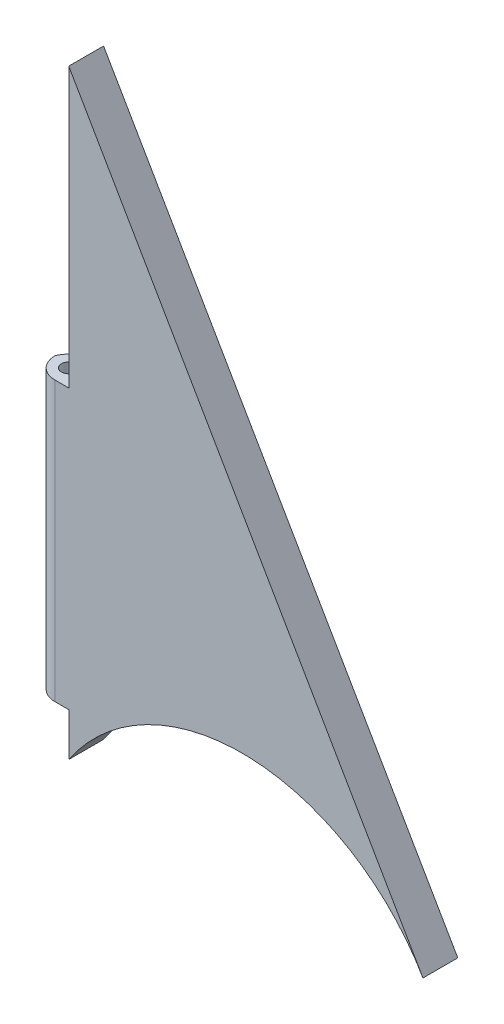
ISO-10303-21;
HEADER;
FILE_DESCRIPTION(('STEP AP214'),'2;1');
FILE_NAME('part.step','',(''),(''),'','','');
FILE_SCHEMA(('AUTOMOTIVE_DESIGN { 1 0 10303 214 1 1 1 1 }'));
ENDSEC;
DATA;
#1=APPLICATION_CONTEXT('core data for automotive mechanical design processes');
#2=APPLICATION_PROTOCOL_DEFINITION('international standard','automotive_design',2000,#1);
#3=PRODUCT_CONTEXT('',#1,'mechanical');
#4=PRODUCT('Part','Part','',(#3));
#5=PRODUCT_RELATED_PRODUCT_CATEGORY('part','',(#4));
#6=PRODUCT_DEFINITION_FORMATION('','',#4);
#7=PRODUCT_DEFINITION_CONTEXT('part definition',#1,'design');
#8=PRODUCT_DEFINITION('design','',#6,#7);
#9=PRODUCT_DEFINITION_SHAPE('','',#8);
#10=(LENGTH_UNIT() NAMED_UNIT(*) SI_UNIT(.MILLI.,.METRE.));
#11=(NAMED_UNIT(*) PLANE_ANGLE_UNIT() SI_UNIT($,.RADIAN.));
#12=(NAMED_UNIT(*) SI_UNIT($,.STERADIAN.) SOLID_ANGLE_UNIT());
#13=UNCERTAINTY_MEASURE_WITH_UNIT(LENGTH_MEASURE(1.E-05),#10,'distance_accuracy_value','');
#14=(GEOMETRIC_REPRESENTATION_CONTEXT(3) GLOBAL_UNCERTAINTY_ASSIGNED_CONTEXT((#13)) GLOBAL_UNIT_ASSIGNED_CONTEXT((#10,
#11,#12)) REPRESENTATION_CONTEXT('',''));
#15=CARTESIAN_POINT('',(0.,0.,0.));
#16=DIRECTION('',(0.,0.,1.));
#17=DIRECTION('',(1.,0.,0.));
#18=AXIS2_PLACEMENT_3D('',#15,#16,#17);
#19=CARTESIAN_POINT('',(-24.8298059769717,87.5088118938212,5.));
#20=DIRECTION('',(1.,0.,0.));
#21=DIRECTION('',(0.,0.,-1.));
#22=AXIS2_PLACEMENT_3D('',#19,#20,#21);
#23=PLANE('',#22);
#24=DIRECTION('',(0.,0.,-1.));
#25=VECTOR('',#24,1.);
#26=CARTESIAN_POINT('',(-24.8298059769717,47.4898845,5.));
#27=LINE('',#26,#25);
#28=CARTESIAN_POINT('',(-24.8298059769717,47.4898845,5.));
#29=VERTEX_POINT('',#28);
#30=CARTESIAN_POINT('',(-24.8298059769717,47.4898845,0.));
#31=VERTEX_POINT('',#30);
#32=EDGE_CURVE('E167',#29,#31,#27,.T.);
#33=ORIENTED_EDGE('',*,*,#32,.F.);
#34=DIRECTION('',(0.,-1.,0.));
#35=VECTOR('',#34,1.);
#36=CARTESIAN_POINT('',(-24.8298059769717,87.5088118938212,5.));
#37=LINE('',#36,#35);
#38=CARTESIAN_POINT('',(-24.8298059769717,87.5088118938212,5.));
#39=VERTEX_POINT('',#38);
#40=EDGE_CURVE('E119',#39,#29,#37,.T.);
#41=ORIENTED_EDGE('',*,*,#40,.F.);
#42=DIRECTION('',(0.,0.,-1.));
#43=VECTOR('',#42,1.);
#44=CARTESIAN_POINT('',(-24.8298059769717,87.5088118938212,5.));
#45=LINE('',#44,#43);
#46=CARTESIAN_POINT('',(-24.8298059769717,87.5088118938212,0.));
#47=VERTEX_POINT('',#46);
#48=EDGE_CURVE('E142',#39,#47,#45,.T.);
#49=ORIENTED_EDGE('',*,*,#48,.T.);
#50=DIRECTION('',(0.,-1.,0.));
#51=VECTOR('',#50,1.);
#52=CARTESIAN_POINT('',(-24.8298059769717,87.5088118938212,0.));
#53=LINE('',#52,#51);
#54=EDGE_CURVE('E135',#47,#31,#53,.T.);
#55=ORIENTED_EDGE('',*,*,#54,.T.);
#56=EDGE_LOOP('',(#33,#41,#49,#55));
#57=FACE_BOUND('',#56,.T.);
#58=ADVANCED_FACE('F33',(#57),#23,.F.);
#59=CARTESIAN_POINT('',(26.0250210520275,-0.447992933347607,5.));
#60=DIRECTION('',(-0.865714362691107,-0.500538352407016,0.));
#61=DIRECTION('',(0.500538352407016,-0.865714362691107,0.));
#62=AXIS2_PLACEMENT_3D('',#59,#60,#61);
#63=PLANE('',#62);
#64=DIRECTION('',(-0.500538352407016,0.865714362691107,0.));
#65=VECTOR('',#64,1.);
#66=CARTESIAN_POINT('',(26.0250210520275,-0.447992933347607,0.));
#67=LINE('',#66,#65);
#68=CARTESIAN_POINT('',(26.0250210520275,-0.447992933347605,0.));
#69=VERTEX_POINT('',#68);
#70=EDGE_CURVE('E131',#69,#47,#67,.T.);
#71=ORIENTED_EDGE('',*,*,#70,.T.);
#72=ORIENTED_EDGE('',*,*,#48,.F.);
#73=DIRECTION('',(-0.500538352407016,0.865714362691107,0.));
#74=VECTOR('',#73,1.);
#75=CARTESIAN_POINT('',(26.0250210520275,-0.447992933347607,5.));
#76=LINE('',#75,#74);
#77=CARTESIAN_POINT('',(26.0250210520275,-0.447992933347605,5.));
#78=VERTEX_POINT('',#77);
#79=EDGE_CURVE('E120',#78,#39,#76,.T.);
#80=ORIENTED_EDGE('',*,*,#79,.F.);
#81=DIRECTION('',(0.,0.,-1.));
#82=VECTOR('',#81,1.);
#83=CARTESIAN_POINT('',(26.0250210520275,-0.447992933347605,5.));
#84=LINE('',#83,#82);
#85=EDGE_CURVE('E130',#78,#69,#84,.T.);
#86=ORIENTED_EDGE('',*,*,#85,.T.);
#87=EDGE_LOOP('',(#71,#72,#80,#86));
#88=FACE_BOUND('',#87,.T.);
#89=ADVANCED_FACE('F178',(#88),#63,.F.);
#90=CARTESIAN_POINT('',(-24.8298059769717,7.4898845,5.));
#91=VERTEX_POINT('',#90);
#92=CARTESIAN_POINT('',(-24.8298059769717,1.29343973691645,5.));
#93=VERTEX_POINT('',#92);
#94=EDGE_CURVE('E101',#91,#93,#37,.T.);
#95=ORIENTED_EDGE('',*,*,#94,.F.);
#96=DIRECTION('',(0.,0.,-1.));
#97=VECTOR('',#96,1.);
#98=CARTESIAN_POINT('',(-24.8298059769717,7.4898845,5.));
#99=LINE('',#98,#97);
#100=CARTESIAN_POINT('',(-24.8298059769717,7.4898845,0.));
#101=VERTEX_POINT('',#100);
#102=EDGE_CURVE('E106',#91,#101,#99,.T.);
#103=ORIENTED_EDGE('',*,*,#102,.T.);
#104=CARTESIAN_POINT('',(-24.8298059769717,1.29343973691645,0.));
#105=VERTEX_POINT('',#104);
#106=EDGE_CURVE('E134',#101,#105,#53,.T.);
#107=ORIENTED_EDGE('',*,*,#106,.T.);
#108=DIRECTION('',(0.,0.,-1.));
#109=VECTOR('',#108,1.);
#110=CARTESIAN_POINT('',(-24.8298059769717,1.29343973691645,5.));
#111=LINE('',#110,#109);
#112=EDGE_CURVE('E117',#93,#105,#111,.T.);
#113=ORIENTED_EDGE('',*,*,#112,.F.);
#114=EDGE_LOOP('',(#95,#103,#107,#113));
#115=FACE_BOUND('',#114,.T.);
#116=ADVANCED_FACE('F115',(#115),#23,.F.);
#117=CARTESIAN_POINT('',(0.0535901712942575,-15.4641435055581,5.));
#118=DIRECTION('',(0.,0.,-1.));
#119=DIRECTION('',(-1.,0.,0.));
#120=AXIS2_PLACEMENT_3D('',#117,#118,#119);
#121=CYLINDRICAL_SURFACE('',#120,30.);
#122=CARTESIAN_POINT('',(0.0535901712942575,-15.4641435055581,0.));
#123=DIRECTION('',(0.,0.,1.));
#124=DIRECTION('',(1.,0.,0.));
#125=AXIS2_PLACEMENT_3D('',#122,#123,#124);
#126=CIRCLE('',#125,30.);
#127=EDGE_CURVE('E125',#69,#105,#126,.T.);
#128=ORIENTED_EDGE('',*,*,#127,.F.);
#129=ORIENTED_EDGE('',*,*,#85,.F.);
#130=CARTESIAN_POINT('',(0.0535901712942575,-15.4641435055581,5.));
#131=DIRECTION('',(0.,0.,1.));
#132=DIRECTION('',(1.,0.,0.));
#133=AXIS2_PLACEMENT_3D('',#130,#131,#132);
#134=CIRCLE('',#133,30.);
#135=EDGE_CURVE('E123',#78,#93,#134,.T.);
#136=ORIENTED_EDGE('',*,*,#135,.T.);
#137=ORIENTED_EDGE('',*,*,#112,.T.);
#138=EDGE_LOOP('',(#128,#129,#136,#137));
#139=FACE_BOUND('',#138,.T.);
#140=ADVANCED_FACE('F176',(#139),#121,.F.);
#141=CARTESIAN_POINT('',(0.0535901712942575,-15.4641435055581,5.));
#142=DIRECTION('',(0.,0.,1.));
#143=DIRECTION('',(1.,0.,0.));
#144=AXIS2_PLACEMENT_3D('',#141,#142,#143);
#145=PLANE('',#144);
#146=DIRECTION('',(1.,0.,0.));
#147=VECTOR('',#146,1.);
#148=CARTESIAN_POINT('',(-24.8298059769717,47.4898845,5.));
#149=LINE('',#148,#147);
#150=CARTESIAN_POINT('',(-26.8298059769717,47.4898845,5.));
#151=VERTEX_POINT('',#150);
#152=EDGE_CURVE('E165',#151,#29,#149,.T.);
#153=ORIENTED_EDGE('',*,*,#152,.F.);
#154=DIRECTION('',(0.,1.,0.));
#155=VECTOR('',#154,1.);
#156=CARTESIAN_POINT('',(-26.8298059769717,-15.4641435055581,5.));
#157=LINE('',#156,#155);
#158=CARTESIAN_POINT('',(-26.8298059769717,7.4898845,5.));
#159=VERTEX_POINT('',#158);
#160=EDGE_CURVE('E104',#151,#159,#157,.F.);
#161=ORIENTED_EDGE('',*,*,#160,.T.);
#162=DIRECTION('',(1.,0.,0.));
#163=VECTOR('',#162,1.);
#164=CARTESIAN_POINT('',(-24.8298059769717,7.4898845,5.));
#165=LINE('',#164,#163);
#166=EDGE_CURVE('E95',#159,#91,#165,.T.);
#167=ORIENTED_EDGE('',*,*,#166,.T.);
#168=ORIENTED_EDGE('',*,*,#94,.T.);
#169=ORIENTED_EDGE('',*,*,#135,.F.);
#170=ORIENTED_EDGE('',*,*,#79,.T.);
#171=ORIENTED_EDGE('',*,*,#40,.T.);
#172=EDGE_LOOP('',(#153,#161,#167,#168,#169,#170,#171));
#173=FACE_BOUND('',#172,.T.);
#174=ADVANCED_FACE('F98',(#173),#145,.T.);
#175=CARTESIAN_POINT('',(0.0535901712942575,-15.4641435055581,0.));
#176=DIRECTION('',(0.,0.,1.));
#177=DIRECTION('',(1.,0.,0.));
#178=AXIS2_PLACEMENT_3D('',#175,#176,#177);
#179=PLANE('',#178);
#180=DIRECTION('',(-1.,0.,0.));
#181=VECTOR('',#180,1.);
#182=CARTESIAN_POINT('',(-24.8298059769717,7.4898845,0.));
#183=LINE('',#182,#181);
#184=CARTESIAN_POINT('',(-27.0013788522255,7.4898845,0.));
#185=VERTEX_POINT('',#184);
#186=EDGE_CURVE('E111',#101,#185,#183,.T.);
#187=ORIENTED_EDGE('',*,*,#186,.T.);
#188=DIRECTION('',(0.,1.,0.));
#189=VECTOR('',#188,1.);
#190=CARTESIAN_POINT('',(-27.0013788522255,-15.4641435055581,0.));
#191=LINE('',#190,#189);
#192=CARTESIAN_POINT('',(-27.0013788522255,47.4898845,0.));
#193=VERTEX_POINT('',#192);
#194=EDGE_CURVE('E152',#185,#193,#191,.T.);
#195=ORIENTED_EDGE('',*,*,#194,.T.);
#196=DIRECTION('',(-1.,0.,0.));
#197=VECTOR('',#196,1.);
#198=CARTESIAN_POINT('',(-24.8298059769717,47.4898845,0.));
#199=LINE('',#198,#197);
#200=EDGE_CURVE('E107',#31,#193,#199,.T.);
#201=ORIENTED_EDGE('',*,*,#200,.F.);
#202=ORIENTED_EDGE('',*,*,#54,.F.);
#203=ORIENTED_EDGE('',*,*,#70,.F.);
#204=ORIENTED_EDGE('',*,*,#127,.T.);
#205=ORIENTED_EDGE('',*,*,#106,.F.);
#206=EDGE_LOOP('',(#187,#195,#201,#202,#203,#204,#205));
#207=FACE_BOUND('',#206,.T.);
#208=ADVANCED_FACE('F162',(#207),#179,.F.);
#209=CARTESIAN_POINT('',(0.,7.4898845,0.));
#210=DIRECTION('',(0.,-1.,0.));
#211=DIRECTION('',(0.,0.,-1.));
#212=AXIS2_PLACEMENT_3D('',#209,#210,#211);
#213=PLANE('',#212);
#214=CARTESIAN_POINT('',(-27.3298059769717,7.4898845,2.5));
#215=DIRECTION('',(0.,1.,0.));
#216=DIRECTION('',(0.,0.,1.));
#217=AXIS2_PLACEMENT_3D('',#214,#215,#216);
#218=CIRCLE('',#217,1.04882047176918);
#219=CARTESIAN_POINT('',(-27.3298059769717,7.4898845,3.54882047176918));
#220=VERTEX_POINT('',#219);
#221=EDGE_CURVE('E168',#220,#220,#218,.T.);
#222=ORIENTED_EDGE('',*,*,#221,.T.);
#223=EDGE_LOOP('',(#222));
#224=FACE_BOUND('',#223,.T.);
#225=CARTESIAN_POINT('',(-26.8298059769717,7.4898845,2.));
#226=DIRECTION('',(0.,-1.,0.));
#227=DIRECTION('',(0.,0.,-1.));
#228=AXIS2_PLACEMENT_3D('',#225,#226,#227);
#229=CIRCLE('',#228,3.);
#230=CARTESIAN_POINT('',(-29.8298059769717,7.4898845,2.));
#231=VERTEX_POINT('',#230);
#232=EDGE_CURVE('E150',#159,#231,#229,.T.);
#233=ORIENTED_EDGE('',*,*,#232,.T.);
#234=CARTESIAN_POINT('',(-27.0013788522255,7.4898845,3.));
#235=DIRECTION('',(0.,-1.,0.));
#236=DIRECTION('',(0.,0.,-1.));
#237=AXIS2_PLACEMENT_3D('',#234,#235,#236);
#238=CIRCLE('',#237,3.);
#239=EDGE_CURVE('E11',#231,#185,#238,.T.);
#240=ORIENTED_EDGE('',*,*,#239,.T.);
#241=ORIENTED_EDGE('',*,*,#186,.F.);
#242=ORIENTED_EDGE('',*,*,#102,.F.);
#243=ORIENTED_EDGE('',*,*,#166,.F.);
#244=EDGE_LOOP('',(#233,#240,#241,#242,#243));
#245=FACE_BOUND('',#244,.T.);
#246=ADVANCED_FACE('F110',(#224,#245),#213,.T.);
#247=CARTESIAN_POINT('',(0.,47.4898845,0.));
#248=DIRECTION('',(0.,-1.,0.));
#249=DIRECTION('',(0.,0.,-1.));
#250=AXIS2_PLACEMENT_3D('',#247,#248,#249);
#251=PLANE('',#250);
#252=CARTESIAN_POINT('',(-27.3298059769717,47.4898845,2.5));
#253=DIRECTION('',(0.,1.,0.));
#254=DIRECTION('',(0.,0.,1.));
#255=AXIS2_PLACEMENT_3D('',#252,#253,#254);
#256=CIRCLE('',#255,1.04882047176918);
#257=CARTESIAN_POINT('',(-27.3298059769717,47.4898845,3.54882047176918));
#258=VERTEX_POINT('',#257);
#259=EDGE_CURVE('E277',#258,#258,#256,.T.);
#260=ORIENTED_EDGE('',*,*,#259,.F.);
#261=EDGE_LOOP('',(#260));
#262=FACE_BOUND('',#261,.T.);
#263=ORIENTED_EDGE('',*,*,#200,.T.);
#264=CARTESIAN_POINT('',(-27.0013788522255,47.4898845,3.));
#265=DIRECTION('',(0.,-1.,0.));
#266=DIRECTION('',(0.,0.,-1.));
#267=AXIS2_PLACEMENT_3D('',#264,#265,#266);
#268=CIRCLE('',#267,3.);
#269=CARTESIAN_POINT('',(-29.8298059769717,47.4898845,2.));
#270=VERTEX_POINT('',#269);
#271=EDGE_CURVE('E41',#193,#270,#268,.F.);
#272=ORIENTED_EDGE('',*,*,#271,.T.);
#273=CARTESIAN_POINT('',(-26.8298059769717,47.4898845,2.));
#274=DIRECTION('',(0.,-1.,0.));
#275=DIRECTION('',(0.,0.,-1.));
#276=AXIS2_PLACEMENT_3D('',#273,#274,#275);
#277=CIRCLE('',#276,3.);
#278=EDGE_CURVE('E147',#270,#151,#277,.F.);
#279=ORIENTED_EDGE('',*,*,#278,.T.);
#280=ORIENTED_EDGE('',*,*,#152,.T.);
#281=ORIENTED_EDGE('',*,*,#32,.T.);
#282=EDGE_LOOP('',(#263,#272,#279,#280,#281));
#283=FACE_BOUND('',#282,.T.);
#284=ADVANCED_FACE('F156',(#262,#283),#251,.F.);
#285=CARTESIAN_POINT('',(-27.3298059769717,7.4898845,2.5));
#286=DIRECTION('',(0.,1.,0.));
#287=DIRECTION('',(0.,0.,1.));
#288=AXIS2_PLACEMENT_3D('',#285,#286,#287);
#289=CYLINDRICAL_SURFACE('',#288,1.04882047176918);
#290=ORIENTED_EDGE('',*,*,#221,.F.);
#291=EDGE_LOOP('',(#290));
#292=FACE_BOUND('',#291,.T.);
#293=ORIENTED_EDGE('',*,*,#259,.T.);
#294=EDGE_LOOP('',(#293));
#295=FACE_BOUND('',#294,.T.);
#296=ADVANCED_FACE('F188',(#292,#295),#289,.F.);
#297=CARTESIAN_POINT('',(-26.8298059769717,7.4898845,2.));
#298=DIRECTION('',(0.,1.,0.));
#299=DIRECTION('',(0.,0.,1.));
#300=AXIS2_PLACEMENT_3D('',#297,#298,#299);
#301=CYLINDRICAL_SURFACE('',#300,3.);
#302=ORIENTED_EDGE('',*,*,#232,.F.);
#303=ORIENTED_EDGE('',*,*,#160,.F.);
#304=ORIENTED_EDGE('',*,*,#278,.F.);
#305=DIRECTION('',(0.,1.,0.));
#306=VECTOR('',#305,1.);
#307=CARTESIAN_POINT('',(-29.8298059769717,7.4898845,2.));
#308=LINE('',#307,#306);
#309=EDGE_CURVE('E145',#231,#270,#308,.T.);
#310=ORIENTED_EDGE('',*,*,#309,.F.);
#311=EDGE_LOOP('',(#302,#303,#304,#310));
#312=FACE_BOUND('',#311,.T.);
#313=ADVANCED_FACE('F160',(#312),#301,.T.);
#314=CARTESIAN_POINT('',(-27.0013788522255,7.4898845,3.));
#315=DIRECTION('',(0.,1.,0.));
#316=DIRECTION('',(0.,0.,1.));
#317=AXIS2_PLACEMENT_3D('',#314,#315,#316);
#318=CYLINDRICAL_SURFACE('',#317,3.);
#319=ORIENTED_EDGE('',*,*,#239,.F.);
#320=ORIENTED_EDGE('',*,*,#309,.T.);
#321=ORIENTED_EDGE('',*,*,#271,.F.);
#322=ORIENTED_EDGE('',*,*,#194,.F.);
#323=EDGE_LOOP('',(#319,#320,#321,#322));
#324=FACE_BOUND('',#323,.T.);
#325=ADVANCED_FACE('F35',(#324),#318,.T.);
#326=CLOSED_SHELL('',(#58,#89,#116,#140,#174,#208,#246,#284,#296,#313,#325));
#327=MANIFOLD_SOLID_BREP('B2',#326);
#328=ADVANCED_BREP_SHAPE_REPRESENTATION('',(#18,#327),#14);
#329=SHAPE_DEFINITION_REPRESENTATION(#9,#328);
ENDSEC;
END-ISO-10303-21;
